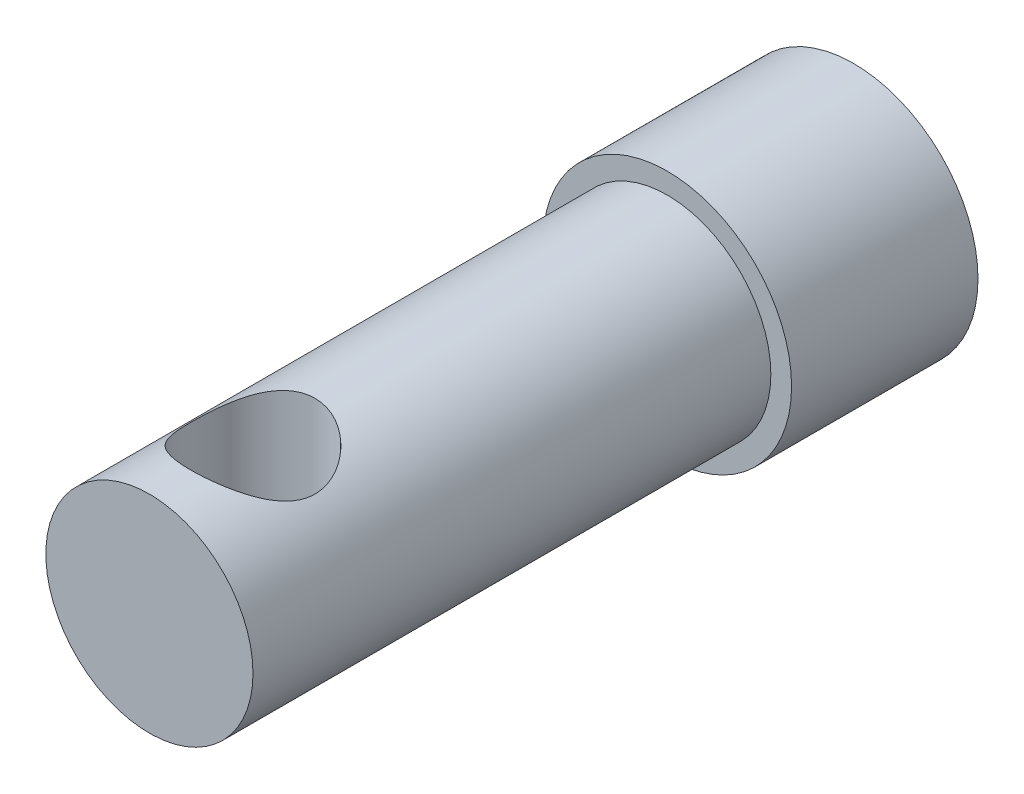
ISO-10303-21;
HEADER;
FILE_DESCRIPTION(('STEP AP214'),'2;1');
FILE_NAME('part.step','',(''),(''),'','','');
FILE_SCHEMA(('AUTOMOTIVE_DESIGN { 1 0 10303 214 1 1 1 1 }'));
ENDSEC;
DATA;
#1=APPLICATION_CONTEXT('core data for automotive mechanical design processes');
#2=APPLICATION_PROTOCOL_DEFINITION('international standard','automotive_design',2000,#1);
#3=PRODUCT_CONTEXT('',#1,'mechanical');
#4=PRODUCT('Part','Part','',(#3));
#5=PRODUCT_RELATED_PRODUCT_CATEGORY('part','',(#4));
#6=PRODUCT_DEFINITION_FORMATION('','',#4);
#7=PRODUCT_DEFINITION_CONTEXT('part definition',#1,'design');
#8=PRODUCT_DEFINITION('design','',#6,#7);
#9=PRODUCT_DEFINITION_SHAPE('','',#8);
#10=(LENGTH_UNIT() NAMED_UNIT(*) SI_UNIT(.MILLI.,.METRE.));
#11=(NAMED_UNIT(*) PLANE_ANGLE_UNIT() SI_UNIT($,.RADIAN.));
#12=(NAMED_UNIT(*) SI_UNIT($,.STERADIAN.) SOLID_ANGLE_UNIT());
#13=UNCERTAINTY_MEASURE_WITH_UNIT(LENGTH_MEASURE(1.E-05),#10,'distance_accuracy_value','');
#14=(GEOMETRIC_REPRESENTATION_CONTEXT(3) GLOBAL_UNCERTAINTY_ASSIGNED_CONTEXT((#13)) GLOBAL_UNIT_ASSIGNED_CONTEXT((#10,
#11,#12)) REPRESENTATION_CONTEXT('',''));
#15=CARTESIAN_POINT('',(0.,0.,0.));
#16=DIRECTION('',(0.,0.,1.));
#17=DIRECTION('',(1.,0.,0.));
#18=AXIS2_PLACEMENT_3D('',#15,#16,#17);
#19=CARTESIAN_POINT('',(0.,0.,34.));
#20=DIRECTION('',(0.,0.,-1.));
#21=DIRECTION('',(-1.,0.,0.));
#22=AXIS2_PLACEMENT_3D('',#19,#20,#21);
#23=CYLINDRICAL_SURFACE('',#22,5.);
#24=CARTESIAN_POINT('',(0.,5.,26.));
#25=CARTESIAN_POINT('',(0.0767697294351707,4.99999907546385,26.0000010562445));
#26=CARTESIAN_POINT('',(0.153562134518387,4.99822567812271,26.0029535935701));
#27=CARTESIAN_POINT('',(0.306548487758715,4.99118362570631,26.0147142329797));
#28=CARTESIAN_POINT('',(0.382742059346593,4.98591292553957,26.0235257611882));
#29=CARTESIAN_POINT('',(0.609808130024628,4.96499345352549,26.0586485594631));
#30=CARTESIAN_POINT('',(0.758981863291667,4.94423772571335,26.0936477024334));
#31=CARTESIAN_POINT('',(1.04754167363585,4.89123238995897,26.1847727435041));
#32=CARTESIAN_POINT('',(1.18697226741342,4.8590397955111,26.2407939220127));
#33=CARTESIAN_POINT('',(1.45405042800218,4.7859070225578,26.371720660597));
#34=CARTESIAN_POINT('',(1.58170090938261,4.74496901614699,26.4466215323602));
#35=CARTESIAN_POINT('',(1.83260160381823,4.65410731283371,26.6195496551151));
#36=CARTESIAN_POINT('',(1.95476885986166,4.60373587041895,26.7189073911665));
#37=CARTESIAN_POINT('',(2.1817645874806,4.50060875905921,26.9349344071922));
#38=CARTESIAN_POINT('',(2.28657046750404,4.4478500955754,27.0516258742183));
#39=CARTESIAN_POINT('',(2.48890019509838,4.33822134833335,27.3158470211689));
#40=CARTESIAN_POINT('',(2.5839553962784,4.28164035635797,27.4654035421222));
#41=CARTESIAN_POINT('',(2.74722868670786,4.17876602596121,27.7816931463269));
#42=CARTESIAN_POINT('',(2.8154903315581,4.13245604474886,27.9483977920332));
#43=CARTESIAN_POINT('',(2.90881204577224,4.06709259377223,28.2531929016569));
#44=CARTESIAN_POINT('',(2.94032394587637,4.04415766338645,28.3884719983614));
#45=CARTESIAN_POINT('',(2.98432344587083,4.01180616527621,28.6636074305214));
#46=CARTESIAN_POINT('',(2.99683469884359,4.00237279089368,28.803457853304));
#47=CARTESIAN_POINT('',(3.0021101681982,3.99841845126251,29.0840229926479));
#48=CARTESIAN_POINT('',(2.99483563630785,4.00392674756739,29.2247388659119));
#49=CARTESIAN_POINT('',(2.96092124146105,4.02906522155629,29.5025575351179));
#50=CARTESIAN_POINT('',(2.93426681225442,4.04870602134773,29.6396575329415));
#51=CARTESIAN_POINT('',(2.86347831933193,4.09906376582928,29.9050605422505));
#52=CARTESIAN_POINT('',(2.8195745342289,4.12963433300037,30.0334543229945));
#53=CARTESIAN_POINT('',(2.71590167467071,4.19854092703026,30.2813897666318));
#54=CARTESIAN_POINT('',(2.65612678414159,4.2368797994146,30.400928163829));
#55=CARTESIAN_POINT('',(2.5103577382067,4.32510698365561,30.6499691376563));
#56=CARTESIAN_POINT('',(2.42160671901867,4.3758426358075,30.7775599923677));
#57=CARTESIAN_POINT('',(2.22582963207776,4.4786102252415,31.0173491572201));
#58=CARTESIAN_POINT('',(2.11878609335504,4.53064336077653,31.1295325654021));
#59=CARTESIAN_POINT('',(1.87159040921357,4.63871766962913,31.3512422594485));
#60=CARTESIAN_POINT('',(1.72890315178768,4.69430681953073,31.4582193912373));
#61=CARTESIAN_POINT('',(1.50061053630278,4.77018325995047,31.5992687127229));
#62=CARTESIAN_POINT('',(1.42209821815681,4.79423315237467,31.6430641355161));
#63=CARTESIAN_POINT('',(1.26074368673913,4.83916496756429,31.723718823611));
#64=CARTESIAN_POINT('',(1.17790417501176,4.86004883588963,31.7605823520208));
#65=CARTESIAN_POINT('',(1.01376371174001,4.8968267274493,31.8248114428566));
#66=CARTESIAN_POINT('',(0.932690066663957,4.91295100454953,31.8526265604492));
#67=CARTESIAN_POINT('',(0.767879949732826,4.94139126794745,31.9013339558452));
#68=CARTESIAN_POINT('',(0.684144997174636,4.95370938553284,31.9222301084464));
#69=CARTESIAN_POINT('',(0.514744462654421,4.97416370514887,31.9567718547248));
#70=CARTESIAN_POINT('',(0.429080341969608,4.98230296820872,31.9704227558286));
#71=CARTESIAN_POINT('',(0.256621746592204,4.99415996414414,31.9902661843902));
#72=CARTESIAN_POINT('',(0.169827432617757,4.99787831889699,31.9964597608513));
#73=CARTESIAN_POINT('',(-0.067324257110645,5.00179157954795,32.0029926702836));
#74=CARTESIAN_POINT('',(-0.218056842610663,4.99746512571837,31.9958115456306));
#75=CARTESIAN_POINT('',(-0.515686907628998,4.97557955020067,31.9591544582709));
#76=CARTESIAN_POINT('',(-0.662584464852967,4.95802069684413,31.9296789476581));
#77=CARTESIAN_POINT('',(-0.945142599254814,4.91189447655688,31.8509115408157));
#78=CARTESIAN_POINT('',(-1.08098954856944,4.88360514429733,31.802118873408));
#79=CARTESIAN_POINT('',(-1.34253345184752,4.81827798628348,31.6866456757991));
#80=CARTESIAN_POINT('',(-1.46822839746276,4.78123843515362,31.6199616174059));
#81=CARTESIAN_POINT('',(-1.72001192130151,4.69690981059277,31.462885909022));
#82=CARTESIAN_POINT('',(-1.84478813824221,4.6489560240695,31.3707523061625));
#83=CARTESIAN_POINT('',(-2.07805222548222,4.54948534225871,31.1692172487452));
#84=CARTESIAN_POINT('',(-2.18652085154156,4.49796434043363,31.0597957003973));
#85=CARTESIAN_POINT('',(-2.39863988264158,4.38890846835682,30.8101792085068));
#86=CARTESIAN_POINT('',(-2.49982037884172,4.33146483230154,30.667832226057));
#87=CARTESIAN_POINT('',(-2.67690479207535,4.22432364395571,30.3655679538724));
#88=CARTESIAN_POINT('',(-2.75283533845462,4.1746179606141,30.2056694128488));
#89=CARTESIAN_POINT('',(-2.86285157351706,4.09969818429266,29.9075139548893));
#90=CARTESIAN_POINT('',(-2.90243250662613,4.07151318633887,29.772039375358));
#91=CARTESIAN_POINT('',(-2.96227327821697,4.02819211510624,29.4949358437648));
#92=CARTESIAN_POINT('',(-2.98255990395067,4.01303795327895,29.3533157105485));
#93=CARTESIAN_POINT('',(-3.00268261034206,3.99800893189922,29.0672461056048));
#94=CARTESIAN_POINT('',(-3.00244179030845,3.99819152744816,28.9227880217517));
#95=CARTESIAN_POINT('',(-2.98132945103105,4.01395435932838,28.6362111256536));
#96=CARTESIAN_POINT('',(-2.96044671369591,4.02954296823692,28.4940936281252));
#97=CARTESIAN_POINT('',(-2.90080351212233,4.07266369966216,28.2230231760049));
#98=CARTESIAN_POINT('',(-2.86295284328648,4.09958421715569,28.0937658520756));
#99=CARTESIAN_POINT('',(-2.77126473512031,4.16211005816609,27.8433254503469));
#100=CARTESIAN_POINT('',(-2.7174212751772,4.19771865147484,27.722145434387));
#101=CARTESIAN_POINT('',(-2.58578536859698,4.28025972950371,27.47136046054));
#102=CARTESIAN_POINT('',(-2.50558518231556,4.32809142579694,27.3433184917852));
#103=CARTESIAN_POINT('',(-2.32751213746958,4.42640286674054,27.1012391546934));
#104=CARTESIAN_POINT('',(-2.22962472612067,4.47688476749087,26.9872134495205));
#105=CARTESIAN_POINT('',(-2.00020353552556,4.5845123827036,26.7573011566705));
#106=CARTESIAN_POINT('',(-1.86578571790514,4.64140045738634,26.6441501201384));
#107=CARTESIAN_POINT('',(-1.57689277813436,4.74731429537958,26.4417920139519));
#108=CARTESIAN_POINT('',(-1.42241049573676,4.79633723789531,26.3525935270803));
#109=CARTESIAN_POINT('',(-1.18102189661686,4.85920558314903,26.2408755258095));
#110=CARTESIAN_POINT('',(-1.10025014285136,4.87817139185349,26.2076640040355));
#111=CARTESIAN_POINT('',(-0.935442217988387,4.91243413775203,26.1482278618565));
#112=CARTESIAN_POINT('',(-0.851407984788101,4.9277332153652,26.1219991642991));
#113=CARTESIAN_POINT('',(-0.681001816074567,4.95415527987996,26.0769905579243));
#114=CARTESIAN_POINT('',(-0.594637500609293,4.9652904423195,26.0581889226967));
#115=CARTESIAN_POINT('',(-0.420183746020764,4.98308318645253,26.028255644677));
#116=CARTESIAN_POINT('',(-0.332095806784398,4.98974449723791,26.0171176138467));
#117=CARTESIAN_POINT('',(-0.203123929661339,4.99603728421477,26.0066083161947));
#118=CARTESIAN_POINT('',(-0.16255628111349,4.99752198179196,26.004131569546));
#119=CARTESIAN_POINT('',(-0.0813278781867691,4.99950360169341,26.0008271030861));
#120=CARTESIAN_POINT('',(-0.0406671206271725,5.00000048975323,25.9999994404771));
#121=CARTESIAN_POINT('',(0.,5.,26.));
#122=B_SPLINE_CURVE_WITH_KNOTS('',3,(#24,#25,#26,#27,#28,#29,#30,#31,#32,#33,#34,#35,#36,#37,
#38,#39,#40,#41,#42,#43,#44,#45,#46,#47,#48,#49,#50,#51,#52,#53,#54,#55,#56,#57,#58,#59,#60,#61,
#62,#63,#64,#65,#66,#67,#68,#69,#70,#71,#72,#73,#74,#75,#76,#77,#78,#79,#80,#81,#82,#83,#84,#85,
#86,#87,#88,#89,#90,#91,#92,#93,#94,#95,#96,#97,#98,#99,#100,#101,#102,#103,#104,#105,#106,#107,
#108,#109,#110,#111,#112,#113,#114,#115,#116,#117,#118,#119,#120,#121),.UNSPECIFIED.,.T.,.F.,(4,
2,2,2,2,2,2,2,2,2,2,2,2,2,2,2,2,2,2,2,2,2,2,2,2,2,2,2,2,2,2,2,2,2,2,2,2,2,2,2,2,2,2,2,2,2,2,2,
4),(0.,0.230263300595003,0.4606613693334,0.922002149276126,1.38107466343613,1.84003329022065,
2.33408870888555,2.82878205293211,3.38413315803225,3.93857770807794,4.35913349134877,
4.77916531256766,5.20002031165062,5.62119195971355,6.03692224610024,6.45280509043347,
6.94139679873935,7.43045779030958,7.98767605192992,8.26653157143431,8.54521503013734,
8.80648473589063,9.06760787545943,9.32853946730961,9.58943435026958,10.0398406663534,
10.490237849174,10.9296843257003,11.3692175250854,11.8543559282721,12.3400624135416,
12.889063860465,13.437484464234,13.8674843581987,14.2968863865712,14.7278971274535,
15.1591422350194,15.5696105785277,15.9802336423656,16.4539008129506,16.927959499309,
17.4794148474152,18.0310675325446,18.2988384573895,18.5664526907294,18.8332781687618,
19.0998809626714,19.221853785686,19.3438308395353),.UNSPECIFIED.);
#123=CARTESIAN_POINT('',(0.,5.,26.));
#124=VERTEX_POINT('',#123);
#125=EDGE_CURVE('E41',#124,#124,#122,.T.);
#126=ORIENTED_EDGE('',*,*,#125,.T.);
#127=EDGE_LOOP('',(#126));
#128=FACE_BOUND('',#127,.T.);
#129=CARTESIAN_POINT('',(0.,-5.,26.));
#130=CARTESIAN_POINT('',(-0.0767697294351707,-4.99999907546385,26.0000010562445));
#131=CARTESIAN_POINT('',(-0.153562134518387,-4.99822567812271,26.0029535935701));
#132=CARTESIAN_POINT('',(-0.306548487758715,-4.99118362570631,26.0147142329797));
#133=CARTESIAN_POINT('',(-0.382742059346593,-4.98591292553957,26.0235257611882));
#134=CARTESIAN_POINT('',(-0.609808130024628,-4.96499345352549,26.0586485594631));
#135=CARTESIAN_POINT('',(-0.758981863291667,-4.94423772571335,26.0936477024334));
#136=CARTESIAN_POINT('',(-1.04754167363585,-4.89123238995897,26.1847727435041));
#137=CARTESIAN_POINT('',(-1.18697226741342,-4.8590397955111,26.2407939220127));
#138=CARTESIAN_POINT('',(-1.45405042800218,-4.7859070225578,26.371720660597));
#139=CARTESIAN_POINT('',(-1.58170090938261,-4.74496901614699,26.4466215323602));
#140=CARTESIAN_POINT('',(-1.83260160381823,-4.65410731283371,26.6195496551151));
#141=CARTESIAN_POINT('',(-1.95476885986166,-4.60373587041895,26.7189073911665));
#142=CARTESIAN_POINT('',(-2.1817645874806,-4.50060875905921,26.9349344071922));
#143=CARTESIAN_POINT('',(-2.28657046750404,-4.4478500955754,27.0516258742183));
#144=CARTESIAN_POINT('',(-2.48890019509838,-4.33822134833335,27.3158470211689));
#145=CARTESIAN_POINT('',(-2.5839553962784,-4.28164035635797,27.4654035421222));
#146=CARTESIAN_POINT('',(-2.74722868670786,-4.17876602596121,27.7816931463269));
#147=CARTESIAN_POINT('',(-2.8154903315581,-4.13245604474886,27.9483977920332));
#148=CARTESIAN_POINT('',(-2.90881204577224,-4.06709259377223,28.2531929016569));
#149=CARTESIAN_POINT('',(-2.94032394587637,-4.04415766338645,28.3884719983614));
#150=CARTESIAN_POINT('',(-2.98432344587083,-4.01180616527621,28.6636074305214));
#151=CARTESIAN_POINT('',(-2.99683469884359,-4.00237279089368,28.803457853304));
#152=CARTESIAN_POINT('',(-3.0021101681982,-3.99841845126251,29.0840229926479));
#153=CARTESIAN_POINT('',(-2.99483563630785,-4.00392674756739,29.2247388659119));
#154=CARTESIAN_POINT('',(-2.96092124146105,-4.02906522155629,29.5025575351179));
#155=CARTESIAN_POINT('',(-2.93426681225442,-4.04870602134773,29.6396575329415));
#156=CARTESIAN_POINT('',(-2.86347831933193,-4.09906376582928,29.9050605422505));
#157=CARTESIAN_POINT('',(-2.8195745342289,-4.12963433300037,30.0334543229945));
#158=CARTESIAN_POINT('',(-2.71590167467071,-4.19854092703026,30.2813897666318));
#159=CARTESIAN_POINT('',(-2.65612678414159,-4.2368797994146,30.400928163829));
#160=CARTESIAN_POINT('',(-2.5103577382067,-4.32510698365561,30.6499691376563));
#161=CARTESIAN_POINT('',(-2.42160671901867,-4.3758426358075,30.7775599923677));
#162=CARTESIAN_POINT('',(-2.22582963207776,-4.4786102252415,31.0173491572201));
#163=CARTESIAN_POINT('',(-2.11878609335504,-4.53064336077653,31.1295325654021));
#164=CARTESIAN_POINT('',(-1.87159040921357,-4.63871766962913,31.3512422594485));
#165=CARTESIAN_POINT('',(-1.72890315178768,-4.69430681953073,31.4582193912373));
#166=CARTESIAN_POINT('',(-1.50061053630278,-4.77018325995047,31.5992687127229));
#167=CARTESIAN_POINT('',(-1.42209821815681,-4.79423315237467,31.6430641355161));
#168=CARTESIAN_POINT('',(-1.26074368673913,-4.83916496756429,31.723718823611));
#169=CARTESIAN_POINT('',(-1.17790417501176,-4.86004883588963,31.7605823520208));
#170=CARTESIAN_POINT('',(-1.01376371174001,-4.8968267274493,31.8248114428566));
#171=CARTESIAN_POINT('',(-0.932690066663957,-4.91295100454953,31.8526265604492));
#172=CARTESIAN_POINT('',(-0.767879949732826,-4.94139126794745,31.9013339558452));
#173=CARTESIAN_POINT('',(-0.684144997174636,-4.95370938553284,31.9222301084464));
#174=CARTESIAN_POINT('',(-0.514744462654421,-4.97416370514887,31.9567718547248));
#175=CARTESIAN_POINT('',(-0.429080341969608,-4.98230296820872,31.9704227558286));
#176=CARTESIAN_POINT('',(-0.256621746592204,-4.99415996414414,31.9902661843902));
#177=CARTESIAN_POINT('',(-0.169827432617757,-4.99787831889699,31.9964597608513));
#178=CARTESIAN_POINT('',(0.067324257110645,-5.00179157954795,32.0029926702836));
#179=CARTESIAN_POINT('',(0.218056842610663,-4.99746512571837,31.9958115456306));
#180=CARTESIAN_POINT('',(0.515686907628998,-4.97557955020067,31.9591544582709));
#181=CARTESIAN_POINT('',(0.662584464852967,-4.95802069684413,31.9296789476581));
#182=CARTESIAN_POINT('',(0.945142599254814,-4.91189447655688,31.8509115408157));
#183=CARTESIAN_POINT('',(1.08098954856944,-4.88360514429733,31.802118873408));
#184=CARTESIAN_POINT('',(1.34253345184752,-4.81827798628348,31.6866456757991));
#185=CARTESIAN_POINT('',(1.46822839746276,-4.78123843515362,31.6199616174059));
#186=CARTESIAN_POINT('',(1.72001192130151,-4.69690981059277,31.462885909022));
#187=CARTESIAN_POINT('',(1.84478813824221,-4.6489560240695,31.3707523061625));
#188=CARTESIAN_POINT('',(2.07805222548222,-4.54948534225871,31.1692172487452));
#189=CARTESIAN_POINT('',(2.18652085154156,-4.49796434043363,31.0597957003973));
#190=CARTESIAN_POINT('',(2.39863988264158,-4.38890846835682,30.8101792085068));
#191=CARTESIAN_POINT('',(2.49982037884172,-4.33146483230154,30.667832226057));
#192=CARTESIAN_POINT('',(2.67690479207535,-4.22432364395571,30.3655679538724));
#193=CARTESIAN_POINT('',(2.75283533845462,-4.1746179606141,30.2056694128488));
#194=CARTESIAN_POINT('',(2.86285157351706,-4.09969818429266,29.9075139548893));
#195=CARTESIAN_POINT('',(2.90243250662613,-4.07151318633887,29.772039375358));
#196=CARTESIAN_POINT('',(2.96227327821697,-4.02819211510624,29.4949358437648));
#197=CARTESIAN_POINT('',(2.98255990395067,-4.01303795327895,29.3533157105485));
#198=CARTESIAN_POINT('',(3.00268261034206,-3.99800893189922,29.0672461056048));
#199=CARTESIAN_POINT('',(3.00244179030845,-3.99819152744816,28.9227880217517));
#200=CARTESIAN_POINT('',(2.98132945103105,-4.01395435932838,28.6362111256536));
#201=CARTESIAN_POINT('',(2.96044671369591,-4.02954296823692,28.4940936281252));
#202=CARTESIAN_POINT('',(2.90080351212233,-4.07266369966216,28.2230231760049));
#203=CARTESIAN_POINT('',(2.86295284328648,-4.09958421715569,28.0937658520756));
#204=CARTESIAN_POINT('',(2.77126473512031,-4.16211005816609,27.8433254503469));
#205=CARTESIAN_POINT('',(2.7174212751772,-4.19771865147484,27.722145434387));
#206=CARTESIAN_POINT('',(2.58578536859698,-4.28025972950371,27.47136046054));
#207=CARTESIAN_POINT('',(2.50558518231556,-4.32809142579694,27.3433184917852));
#208=CARTESIAN_POINT('',(2.32751213746958,-4.42640286674054,27.1012391546934));
#209=CARTESIAN_POINT('',(2.22962472612067,-4.47688476749087,26.9872134495205));
#210=CARTESIAN_POINT('',(2.00020353552556,-4.5845123827036,26.7573011566705));
#211=CARTESIAN_POINT('',(1.86578571790514,-4.64140045738634,26.6441501201384));
#212=CARTESIAN_POINT('',(1.57689277813436,-4.74731429537958,26.4417920139519));
#213=CARTESIAN_POINT('',(1.42241049573676,-4.79633723789531,26.3525935270803));
#214=CARTESIAN_POINT('',(1.18102189661686,-4.85920558314903,26.2408755258095));
#215=CARTESIAN_POINT('',(1.10025014285136,-4.87817139185349,26.2076640040355));
#216=CARTESIAN_POINT('',(0.935442217988387,-4.91243413775203,26.1482278618565));
#217=CARTESIAN_POINT('',(0.851407984788101,-4.9277332153652,26.1219991642991));
#218=CARTESIAN_POINT('',(0.681001816074567,-4.95415527987996,26.0769905579243));
#219=CARTESIAN_POINT('',(0.594637500609293,-4.9652904423195,26.0581889226967));
#220=CARTESIAN_POINT('',(0.420183746020764,-4.98308318645253,26.028255644677));
#221=CARTESIAN_POINT('',(0.332095806784398,-4.98974449723791,26.0171176138467));
#222=CARTESIAN_POINT('',(0.203123929661339,-4.99603728421477,26.0066083161947));
#223=CARTESIAN_POINT('',(0.16255628111349,-4.99752198179196,26.004131569546));
#224=CARTESIAN_POINT('',(0.0813278781867691,-4.99950360169341,26.0008271030861));
#225=CARTESIAN_POINT('',(0.0406671206271725,-5.00000048975323,25.9999994404771));
#226=CARTESIAN_POINT('',(0.,-5.,26.));
#227=B_SPLINE_CURVE_WITH_KNOTS('',3,(#129,#130,#131,#132,#133,#134,#135,#136,#137,#138,#139,
#140,#141,#142,#143,#144,#145,#146,#147,#148,#149,#150,#151,#152,#153,#154,#155,#156,#157,#158,
#159,#160,#161,#162,#163,#164,#165,#166,#167,#168,#169,#170,#171,#172,#173,#174,#175,#176,#177,
#178,#179,#180,#181,#182,#183,#184,#185,#186,#187,#188,#189,#190,#191,#192,#193,#194,#195,#196,
#197,#198,#199,#200,#201,#202,#203,#204,#205,#206,#207,#208,#209,#210,#211,#212,#213,#214,#215,
#216,#217,#218,#219,#220,#221,#222,#223,#224,#225,#226),.UNSPECIFIED.,.T.,.F.,(4,2,2,2,2,2,2,2,
2,2,2,2,2,2,2,2,2,2,2,2,2,2,2,2,2,2,2,2,2,2,2,2,2,2,2,2,2,2,2,2,2,2,2,2,2,2,2,2,4),(0.,
0.230263300595003,0.4606613693334,0.922002149276126,1.38107466343613,1.84003329022065,
2.33408870888555,2.82878205293211,3.38413315803225,3.93857770807794,4.35913349134877,
4.77916531256766,5.20002031165062,5.62119195971355,6.03692224610024,6.45280509043347,
6.94139679873935,7.43045779030958,7.98767605192992,8.26653157143431,8.54521503013734,
8.80648473589063,9.06760787545943,9.32853946730961,9.58943435026958,10.0398406663534,
10.490237849174,10.9296843257003,11.3692175250854,11.8543559282721,12.3400624135416,
12.889063860465,13.437484464234,13.8674843581987,14.2968863865712,14.7278971274535,
15.1591422350194,15.5696105785277,15.9802336423656,16.4539008129506,16.927959499309,
17.4794148474152,18.0310675325446,18.2988384573895,18.5664526907294,18.8332781687618,
19.0998809626714,19.221853785686,19.3438308395353),.UNSPECIFIED.);
#228=CARTESIAN_POINT('',(0.,-5.,26.));
#229=VERTEX_POINT('',#228);
#230=EDGE_CURVE('E11',#229,#229,#227,.T.);
#231=ORIENTED_EDGE('',*,*,#230,.T.);
#232=EDGE_LOOP('',(#231));
#233=FACE_BOUND('',#232,.T.);
#234=CARTESIAN_POINT('',(0.,0.,9.));
#235=DIRECTION('',(0.,0.,1.));
#236=DIRECTION('',(1.,0.,0.));
#237=AXIS2_PLACEMENT_3D('',#234,#235,#236);
#238=CIRCLE('',#237,5.);
#239=CARTESIAN_POINT('',(5.,0.,9.));
#240=VERTEX_POINT('',#239);
#241=EDGE_CURVE('E174',#240,#240,#238,.T.);
#242=ORIENTED_EDGE('',*,*,#241,.T.);
#243=EDGE_LOOP('',(#242));
#244=FACE_BOUND('',#243,.T.);
#245=CARTESIAN_POINT('',(0.,0.,34.));
#246=DIRECTION('',(0.,0.,1.));
#247=DIRECTION('',(1.,0.,0.));
#248=AXIS2_PLACEMENT_3D('',#245,#246,#247);
#249=CIRCLE('',#248,5.);
#250=CARTESIAN_POINT('',(5.,0.,34.));
#251=VERTEX_POINT('',#250);
#252=EDGE_CURVE('E49',#251,#251,#249,.T.);
#253=ORIENTED_EDGE('',*,*,#252,.F.);
#254=EDGE_LOOP('',(#253));
#255=FACE_BOUND('',#254,.T.);
#256=ADVANCED_FACE('F37',(#128,#233,#244,#255),#23,.T.);
#257=CARTESIAN_POINT('',(0.,0.,34.));
#258=DIRECTION('',(0.,0.,1.));
#259=DIRECTION('',(1.,0.,0.));
#260=AXIS2_PLACEMENT_3D('',#257,#258,#259);
#261=PLANE('',#260);
#262=ORIENTED_EDGE('',*,*,#252,.T.);
#263=EDGE_LOOP('',(#262));
#264=FACE_BOUND('',#263,.T.);
#265=ADVANCED_FACE('F221',(#264),#261,.T.);
#266=CARTESIAN_POINT('',(0.,0.,9.));
#267=DIRECTION('',(0.,0.,1.));
#268=DIRECTION('',(1.,0.,0.));
#269=AXIS2_PLACEMENT_3D('',#266,#267,#268);
#270=PLANE('',#269);
#271=CARTESIAN_POINT('',(0.,0.,9.));
#272=DIRECTION('',(0.,0.,1.));
#273=DIRECTION('',(1.,0.,0.));
#274=AXIS2_PLACEMENT_3D('',#271,#272,#273);
#275=CIRCLE('',#274,6.);
#276=CARTESIAN_POINT('',(6.,0.,9.));
#277=VERTEX_POINT('',#276);
#278=EDGE_CURVE('E171',#277,#277,#275,.T.);
#279=ORIENTED_EDGE('',*,*,#278,.T.);
#280=EDGE_LOOP('',(#279));
#281=FACE_BOUND('',#280,.T.);
#282=ORIENTED_EDGE('',*,*,#241,.F.);
#283=EDGE_LOOP('',(#282));
#284=FACE_BOUND('',#283,.T.);
#285=ADVANCED_FACE('F217',(#281,#284),#270,.T.);
#286=CARTESIAN_POINT('',(0.,0.,9.));
#287=DIRECTION('',(0.,0.,-1.));
#288=DIRECTION('',(-1.,0.,0.));
#289=AXIS2_PLACEMENT_3D('',#286,#287,#288);
#290=CYLINDRICAL_SURFACE('',#289,6.);
#291=ORIENTED_EDGE('',*,*,#278,.F.);
#292=EDGE_LOOP('',(#291));
#293=FACE_BOUND('',#292,.T.);
#294=CARTESIAN_POINT('',(0.,0.,0.));
#295=DIRECTION('',(0.,0.,1.));
#296=DIRECTION('',(1.,0.,0.));
#297=AXIS2_PLACEMENT_3D('',#294,#295,#296);
#298=CIRCLE('',#297,6.);
#299=CARTESIAN_POINT('',(6.,0.,0.));
#300=VERTEX_POINT('',#299);
#301=EDGE_CURVE('E161',#300,#300,#298,.T.);
#302=ORIENTED_EDGE('',*,*,#301,.T.);
#303=EDGE_LOOP('',(#302));
#304=FACE_BOUND('',#303,.T.);
#305=ADVANCED_FACE('F220',(#293,#304),#290,.T.);
#306=CARTESIAN_POINT('',(0.,0.,0.));
#307=DIRECTION('',(0.,0.,1.));
#308=DIRECTION('',(1.,0.,0.));
#309=AXIS2_PLACEMENT_3D('',#306,#307,#308);
#310=PLANE('',#309);
#311=DIRECTION('',(0.,1.,0.));
#312=VECTOR('',#311,1.);
#313=CARTESIAN_POINT('',(-3.165,-2.565,0.));
#314=LINE('',#313,#312);
#315=CARTESIAN_POINT('',(-3.165,-2.565,0.));
#316=VERTEX_POINT('',#315);
#317=CARTESIAN_POINT('',(-3.165,2.565,0.));
#318=VERTEX_POINT('',#317);
#319=EDGE_CURVE('E142',#316,#318,#314,.T.);
#320=ORIENTED_EDGE('',*,*,#319,.F.);
#321=CARTESIAN_POINT('',(-2.565,-2.565,0.));
#322=DIRECTION('',(0.,0.,-1.));
#323=DIRECTION('',(-1.,0.,0.));
#324=AXIS2_PLACEMENT_3D('',#321,#322,#323);
#325=CIRCLE('',#324,0.6);
#326=CARTESIAN_POINT('',(-2.565,-3.165,0.));
#327=VERTEX_POINT('',#326);
#328=EDGE_CURVE('E56',#327,#316,#325,.T.);
#329=ORIENTED_EDGE('',*,*,#328,.F.);
#330=DIRECTION('',(-1.,0.,0.));
#331=VECTOR('',#330,1.);
#332=CARTESIAN_POINT('',(-2.565,-3.165,0.));
#333=LINE('',#332,#331);
#334=CARTESIAN_POINT('',(2.565,-3.165,0.));
#335=VERTEX_POINT('',#334);
#336=EDGE_CURVE('E157',#335,#327,#333,.T.);
#337=ORIENTED_EDGE('',*,*,#336,.F.);
#338=CARTESIAN_POINT('',(2.565,-2.565,0.));
#339=DIRECTION('',(0.,0.,-1.));
#340=DIRECTION('',(1.,0.,0.));
#341=AXIS2_PLACEMENT_3D('',#338,#339,#340);
#342=CIRCLE('',#341,0.6);
#343=CARTESIAN_POINT('',(3.165,-2.565,0.));
#344=VERTEX_POINT('',#343);
#345=EDGE_CURVE('E155',#344,#335,#342,.T.);
#346=ORIENTED_EDGE('',*,*,#345,.F.);
#347=DIRECTION('',(0.,-1.,0.));
#348=VECTOR('',#347,1.);
#349=CARTESIAN_POINT('',(3.165,-2.565,0.));
#350=LINE('',#349,#348);
#351=CARTESIAN_POINT('',(3.165,2.56499999999999,0.));
#352=VERTEX_POINT('',#351);
#353=EDGE_CURVE('E116',#352,#344,#350,.T.);
#354=ORIENTED_EDGE('',*,*,#353,.F.);
#355=CARTESIAN_POINT('',(2.565,2.565,0.));
#356=DIRECTION('',(0.,0.,-1.));
#357=DIRECTION('',(-1.,0.,0.));
#358=AXIS2_PLACEMENT_3D('',#355,#356,#357);
#359=CIRCLE('',#358,0.6);
#360=CARTESIAN_POINT('',(2.565,3.165,0.));
#361=VERTEX_POINT('',#360);
#362=EDGE_CURVE('E151',#361,#352,#359,.T.);
#363=ORIENTED_EDGE('',*,*,#362,.F.);
#364=DIRECTION('',(1.,0.,0.));
#365=VECTOR('',#364,1.);
#366=CARTESIAN_POINT('',(-2.565,3.165,0.));
#367=LINE('',#366,#365);
#368=CARTESIAN_POINT('',(-2.565,3.165,0.));
#369=VERTEX_POINT('',#368);
#370=EDGE_CURVE('E148',#369,#361,#367,.T.);
#371=ORIENTED_EDGE('',*,*,#370,.F.);
#372=CARTESIAN_POINT('',(-2.565,2.565,0.));
#373=DIRECTION('',(0.,0.,-1.));
#374=DIRECTION('',(-1.,0.,0.));
#375=AXIS2_PLACEMENT_3D('',#372,#373,#374);
#376=CIRCLE('',#375,0.6);
#377=EDGE_CURVE('E145',#318,#369,#376,.T.);
#378=ORIENTED_EDGE('',*,*,#377,.F.);
#379=EDGE_LOOP('',(#320,#329,#337,#346,#354,#363,#371,#378));
#380=FACE_BOUND('',#379,.T.);
#381=ORIENTED_EDGE('',*,*,#301,.F.);
#382=EDGE_LOOP('',(#381));
#383=FACE_BOUND('',#382,.T.);
#384=ADVANCED_FACE('F216',(#380,#383),#310,.F.);
#385=CARTESIAN_POINT('',(-2.565,-2.565,8.));
#386=DIRECTION('',(0.,0.,-1.));
#387=DIRECTION('',(-1.,0.,0.));
#388=AXIS2_PLACEMENT_3D('',#385,#386,#387);
#389=CYLINDRICAL_SURFACE('',#388,0.6);
#390=ORIENTED_EDGE('',*,*,#328,.T.);
#391=DIRECTION('',(0.,0.,-1.));
#392=VECTOR('',#391,1.);
#393=CARTESIAN_POINT('',(-3.165,-2.565,8.));
#394=LINE('',#393,#392);
#395=CARTESIAN_POINT('',(-3.165,-2.565,8.));
#396=VERTEX_POINT('',#395);
#397=EDGE_CURVE('E92',#396,#316,#394,.T.);
#398=ORIENTED_EDGE('',*,*,#397,.F.);
#399=CARTESIAN_POINT('',(-2.565,-2.565,8.));
#400=DIRECTION('',(0.,0.,-1.));
#401=DIRECTION('',(-1.,0.,0.));
#402=AXIS2_PLACEMENT_3D('',#399,#400,#401);
#403=CIRCLE('',#402,0.6);
#404=CARTESIAN_POINT('',(-2.565,-3.165,8.));
#405=VERTEX_POINT('',#404);
#406=EDGE_CURVE('E159',#405,#396,#403,.T.);
#407=ORIENTED_EDGE('',*,*,#406,.F.);
#408=DIRECTION('',(0.,0.,-1.));
#409=VECTOR('',#408,1.);
#410=CARTESIAN_POINT('',(-2.565,-3.165,8.));
#411=LINE('',#410,#409);
#412=EDGE_CURVE('E64',#405,#327,#411,.T.);
#413=ORIENTED_EDGE('',*,*,#412,.T.);
#414=EDGE_LOOP('',(#390,#398,#407,#413));
#415=FACE_BOUND('',#414,.T.);
#416=ADVANCED_FACE('F194',(#415),#389,.F.);
#417=CARTESIAN_POINT('',(-2.565,-3.165,8.));
#418=DIRECTION('',(0.,-1.,0.));
#419=DIRECTION('',(1.,0.,0.));
#420=AXIS2_PLACEMENT_3D('',#417,#418,#419);
#421=PLANE('',#420);
#422=ORIENTED_EDGE('',*,*,#336,.T.);
#423=ORIENTED_EDGE('',*,*,#412,.F.);
#424=DIRECTION('',(-1.,0.,0.));
#425=VECTOR('',#424,1.);
#426=CARTESIAN_POINT('',(-2.565,-3.165,8.));
#427=LINE('',#426,#425);
#428=CARTESIAN_POINT('',(2.565,-3.165,8.));
#429=VERTEX_POINT('',#428);
#430=EDGE_CURVE('E128',#429,#405,#427,.T.);
#431=ORIENTED_EDGE('',*,*,#430,.F.);
#432=DIRECTION('',(0.,0.,-1.));
#433=VECTOR('',#432,1.);
#434=CARTESIAN_POINT('',(2.565,-3.165,8.));
#435=LINE('',#434,#433);
#436=EDGE_CURVE('E120',#429,#335,#435,.T.);
#437=ORIENTED_EDGE('',*,*,#436,.T.);
#438=EDGE_LOOP('',(#422,#423,#431,#437));
#439=FACE_BOUND('',#438,.T.);
#440=ADVANCED_FACE('F191',(#439),#421,.F.);
#441=CARTESIAN_POINT('',(2.565,-2.565,8.));
#442=DIRECTION('',(0.,0.,-1.));
#443=DIRECTION('',(-1.,0.,0.));
#444=AXIS2_PLACEMENT_3D('',#441,#442,#443);
#445=CYLINDRICAL_SURFACE('',#444,0.6);
#446=ORIENTED_EDGE('',*,*,#345,.T.);
#447=ORIENTED_EDGE('',*,*,#436,.F.);
#448=CARTESIAN_POINT('',(2.565,-2.565,8.));
#449=DIRECTION('',(0.,0.,-1.));
#450=DIRECTION('',(1.,0.,0.));
#451=AXIS2_PLACEMENT_3D('',#448,#449,#450);
#452=CIRCLE('',#451,0.6);
#453=CARTESIAN_POINT('',(3.165,-2.565,8.));
#454=VERTEX_POINT('',#453);
#455=EDGE_CURVE('E124',#454,#429,#452,.T.);
#456=ORIENTED_EDGE('',*,*,#455,.F.);
#457=DIRECTION('',(0.,0.,-1.));
#458=VECTOR('',#457,1.);
#459=CARTESIAN_POINT('',(3.165,-2.565,8.));
#460=LINE('',#459,#458);
#461=EDGE_CURVE('E109',#454,#344,#460,.T.);
#462=ORIENTED_EDGE('',*,*,#461,.T.);
#463=EDGE_LOOP('',(#446,#447,#456,#462));
#464=FACE_BOUND('',#463,.T.);
#465=ADVANCED_FACE('F125',(#464),#445,.F.);
#466=CARTESIAN_POINT('',(3.165,-2.565,8.));
#467=DIRECTION('',(1.,0.,0.));
#468=DIRECTION('',(0.,0.,-1.));
#469=AXIS2_PLACEMENT_3D('',#466,#467,#468);
#470=PLANE('',#469);
#471=ORIENTED_EDGE('',*,*,#353,.T.);
#472=ORIENTED_EDGE('',*,*,#461,.F.);
#473=DIRECTION('',(0.,-1.,0.));
#474=VECTOR('',#473,1.);
#475=CARTESIAN_POINT('',(3.165,-2.565,8.));
#476=LINE('',#475,#474);
#477=CARTESIAN_POINT('',(3.165,2.56499999999999,8.));
#478=VERTEX_POINT('',#477);
#479=EDGE_CURVE('E113',#478,#454,#476,.T.);
#480=ORIENTED_EDGE('',*,*,#479,.F.);
#481=DIRECTION('',(0.,0.,-1.));
#482=VECTOR('',#481,1.);
#483=CARTESIAN_POINT('',(3.165,2.56499999999999,8.));
#484=LINE('',#483,#482);
#485=EDGE_CURVE('E121',#478,#352,#484,.T.);
#486=ORIENTED_EDGE('',*,*,#485,.T.);
#487=EDGE_LOOP('',(#471,#472,#480,#486));
#488=FACE_BOUND('',#487,.T.);
#489=ADVANCED_FACE('F111',(#488),#470,.F.);
#490=CARTESIAN_POINT('',(2.565,2.565,8.));
#491=DIRECTION('',(0.,0.,-1.));
#492=DIRECTION('',(-1.,0.,0.));
#493=AXIS2_PLACEMENT_3D('',#490,#491,#492);
#494=CYLINDRICAL_SURFACE('',#493,0.6);
#495=ORIENTED_EDGE('',*,*,#362,.T.);
#496=ORIENTED_EDGE('',*,*,#485,.F.);
#497=CARTESIAN_POINT('',(2.565,2.565,8.));
#498=DIRECTION('',(0.,0.,-1.));
#499=DIRECTION('',(-1.,0.,0.));
#500=AXIS2_PLACEMENT_3D('',#497,#498,#499);
#501=CIRCLE('',#500,0.6);
#502=CARTESIAN_POINT('',(2.565,3.165,8.));
#503=VERTEX_POINT('',#502);
#504=EDGE_CURVE('E134',#503,#478,#501,.T.);
#505=ORIENTED_EDGE('',*,*,#504,.F.);
#506=DIRECTION('',(0.,0.,-1.));
#507=VECTOR('',#506,1.);
#508=CARTESIAN_POINT('',(2.565,3.165,8.));
#509=LINE('',#508,#507);
#510=EDGE_CURVE('E164',#503,#361,#509,.T.);
#511=ORIENTED_EDGE('',*,*,#510,.T.);
#512=EDGE_LOOP('',(#495,#496,#505,#511));
#513=FACE_BOUND('',#512,.T.);
#514=ADVANCED_FACE('F199',(#513),#494,.F.);
#515=CARTESIAN_POINT('',(-2.565,3.165,8.));
#516=DIRECTION('',(0.,1.,0.));
#517=DIRECTION('',(-1.,0.,0.));
#518=AXIS2_PLACEMENT_3D('',#515,#516,#517);
#519=PLANE('',#518);
#520=ORIENTED_EDGE('',*,*,#370,.T.);
#521=ORIENTED_EDGE('',*,*,#510,.F.);
#522=DIRECTION('',(1.,0.,0.));
#523=VECTOR('',#522,1.);
#524=CARTESIAN_POINT('',(-2.565,3.165,8.));
#525=LINE('',#524,#523);
#526=CARTESIAN_POINT('',(-2.565,3.165,8.));
#527=VERTEX_POINT('',#526);
#528=EDGE_CURVE('E136',#527,#503,#525,.T.);
#529=ORIENTED_EDGE('',*,*,#528,.F.);
#530=DIRECTION('',(0.,0.,-1.));
#531=VECTOR('',#530,1.);
#532=CARTESIAN_POINT('',(-2.565,3.165,8.));
#533=LINE('',#532,#531);
#534=EDGE_CURVE('E166',#527,#369,#533,.T.);
#535=ORIENTED_EDGE('',*,*,#534,.T.);
#536=EDGE_LOOP('',(#520,#521,#529,#535));
#537=FACE_BOUND('',#536,.T.);
#538=ADVANCED_FACE('F202',(#537),#519,.F.);
#539=CARTESIAN_POINT('',(-2.565,2.565,8.));
#540=DIRECTION('',(0.,0.,-1.));
#541=DIRECTION('',(-1.,0.,0.));
#542=AXIS2_PLACEMENT_3D('',#539,#540,#541);
#543=CYLINDRICAL_SURFACE('',#542,0.6);
#544=ORIENTED_EDGE('',*,*,#377,.T.);
#545=ORIENTED_EDGE('',*,*,#534,.F.);
#546=CARTESIAN_POINT('',(-2.565,2.565,8.));
#547=DIRECTION('',(0.,0.,-1.));
#548=DIRECTION('',(-1.,0.,0.));
#549=AXIS2_PLACEMENT_3D('',#546,#547,#548);
#550=CIRCLE('',#549,0.6);
#551=CARTESIAN_POINT('',(-3.165,2.565,8.));
#552=VERTEX_POINT('',#551);
#553=EDGE_CURVE('E346',#552,#527,#550,.T.);
#554=ORIENTED_EDGE('',*,*,#553,.F.);
#555=DIRECTION('',(0.,0.,-1.));
#556=VECTOR('',#555,1.);
#557=CARTESIAN_POINT('',(-3.165,2.565,8.));
#558=LINE('',#557,#556);
#559=EDGE_CURVE('E168',#552,#318,#558,.T.);
#560=ORIENTED_EDGE('',*,*,#559,.T.);
#561=EDGE_LOOP('',(#544,#545,#554,#560));
#562=FACE_BOUND('',#561,.T.);
#563=ADVANCED_FACE('F206',(#562),#543,.F.);
#564=CARTESIAN_POINT('',(-3.165,-2.565,8.));
#565=DIRECTION('',(-1.,0.,0.));
#566=DIRECTION('',(0.,0.,1.));
#567=AXIS2_PLACEMENT_3D('',#564,#565,#566);
#568=PLANE('',#567);
#569=ORIENTED_EDGE('',*,*,#319,.T.);
#570=ORIENTED_EDGE('',*,*,#559,.F.);
#571=DIRECTION('',(0.,1.,0.));
#572=VECTOR('',#571,1.);
#573=CARTESIAN_POINT('',(-3.165,-2.565,8.));
#574=LINE('',#573,#572);
#575=EDGE_CURVE('E344',#396,#552,#574,.T.);
#576=ORIENTED_EDGE('',*,*,#575,.F.);
#577=ORIENTED_EDGE('',*,*,#397,.T.);
#578=EDGE_LOOP('',(#569,#570,#576,#577));
#579=FACE_BOUND('',#578,.T.);
#580=ADVANCED_FACE('F190',(#579),#568,.F.);
#581=CARTESIAN_POINT('',(-2.565,-2.565,8.));
#582=DIRECTION('',(0.,0.,-1.));
#583=DIRECTION('',(-1.,0.,0.));
#584=AXIS2_PLACEMENT_3D('',#581,#582,#583);
#585=PLANE('',#584);
#586=ORIENTED_EDGE('',*,*,#406,.T.);
#587=ORIENTED_EDGE('',*,*,#575,.T.);
#588=ORIENTED_EDGE('',*,*,#553,.T.);
#589=ORIENTED_EDGE('',*,*,#528,.T.);
#590=ORIENTED_EDGE('',*,*,#504,.T.);
#591=ORIENTED_EDGE('',*,*,#479,.T.);
#592=ORIENTED_EDGE('',*,*,#455,.T.);
#593=ORIENTED_EDGE('',*,*,#430,.T.);
#594=EDGE_LOOP('',(#586,#587,#588,#589,#590,#591,#592,#593));
#595=FACE_BOUND('',#594,.T.);
#596=ADVANCED_FACE('F131',(#595),#585,.T.);
#597=CARTESIAN_POINT('',(0.,6.,29.));
#598=DIRECTION('',(0.,-1.,0.));
#599=DIRECTION('',(0.,0.,-1.));
#600=AXIS2_PLACEMENT_3D('',#597,#598,#599);
#601=CYLINDRICAL_SURFACE('',#600,3.);
#602=ORIENTED_EDGE('',*,*,#125,.F.);
#603=EDGE_LOOP('',(#602));
#604=FACE_BOUND('',#603,.T.);
#605=ORIENTED_EDGE('',*,*,#230,.F.);
#606=EDGE_LOOP('',(#605));
#607=FACE_BOUND('',#606,.T.);
#608=ADVANCED_FACE('F182',(#604,#607),#601,.F.);
#609=CLOSED_SHELL('',(#256,#265,#285,#305,#384,#416,#440,#465,#489,#514,#538,#563,#580,#596,#608));
#610=MANIFOLD_SOLID_BREP('B2',#609);
#611=ADVANCED_BREP_SHAPE_REPRESENTATION('',(#18,#610),#14);
#612=SHAPE_DEFINITION_REPRESENTATION(#9,#611);
ENDSEC;
END-ISO-10303-21;
